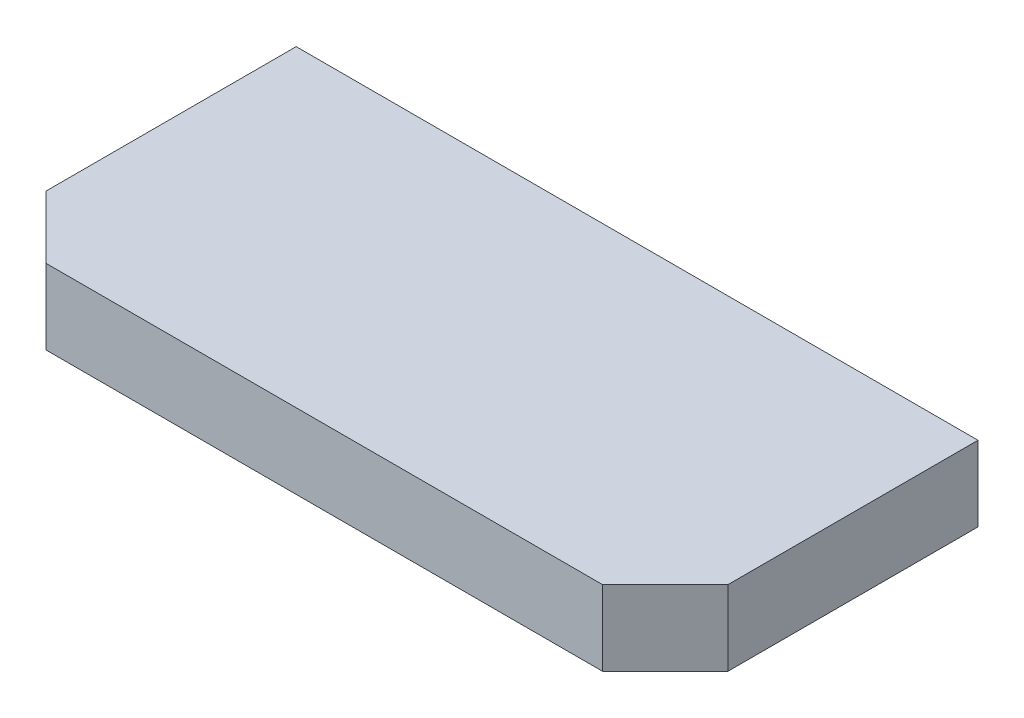
ISO-10303-21;
HEADER;
FILE_DESCRIPTION(('STEP AP214'),'2;1');
FILE_NAME('part.step','',(''),(''),'','','');
FILE_SCHEMA(('AUTOMOTIVE_DESIGN { 1 0 10303 214 1 1 1 1 }'));
ENDSEC;
DATA;
#1=APPLICATION_CONTEXT('core data for automotive mechanical design processes');
#2=APPLICATION_PROTOCOL_DEFINITION('international standard','automotive_design',2000,#1);
#3=PRODUCT_CONTEXT('',#1,'mechanical');
#4=PRODUCT('Part','Part','',(#3));
#5=PRODUCT_RELATED_PRODUCT_CATEGORY('part','',(#4));
#6=PRODUCT_DEFINITION_FORMATION('','',#4);
#7=PRODUCT_DEFINITION_CONTEXT('part definition',#1,'design');
#8=PRODUCT_DEFINITION('design','',#6,#7);
#9=PRODUCT_DEFINITION_SHAPE('','',#8);
#10=(LENGTH_UNIT() NAMED_UNIT(*) SI_UNIT(.MILLI.,.METRE.));
#11=(NAMED_UNIT(*) PLANE_ANGLE_UNIT() SI_UNIT($,.RADIAN.));
#12=(NAMED_UNIT(*) SI_UNIT($,.STERADIAN.) SOLID_ANGLE_UNIT());
#13=UNCERTAINTY_MEASURE_WITH_UNIT(LENGTH_MEASURE(1.E-05),#10,'distance_accuracy_value','');
#14=(GEOMETRIC_REPRESENTATION_CONTEXT(3) GLOBAL_UNCERTAINTY_ASSIGNED_CONTEXT((#13)) GLOBAL_UNIT_ASSIGNED_CONTEXT((#10,
#11,#12)) REPRESENTATION_CONTEXT('',''));
#15=CARTESIAN_POINT('',(0.,0.,0.));
#16=DIRECTION('',(0.,0.,1.));
#17=DIRECTION('',(1.,0.,0.));
#18=AXIS2_PLACEMENT_3D('',#15,#16,#17);
#19=CARTESIAN_POINT('',(27.25,6.,7.5));
#20=DIRECTION('',(-1.,0.,0.));
#21=DIRECTION('',(0.,0.,1.));
#22=AXIS2_PLACEMENT_3D('',#19,#20,#21);
#23=PLANE('',#22);
#24=DIRECTION('',(0.,0.,-1.));
#25=VECTOR('',#24,1.);
#26=CARTESIAN_POINT('',(27.25,0.,7.5));
#27=LINE('',#26,#25);
#28=CARTESIAN_POINT('',(27.25,0.,7.5));
#29=VERTEX_POINT('',#28);
#30=CARTESIAN_POINT('',(27.25,0.,-12.5));
#31=VERTEX_POINT('',#30);
#32=EDGE_CURVE('E120',#29,#31,#27,.T.);
#33=ORIENTED_EDGE('',*,*,#32,.T.);
#34=DIRECTION('',(0.,-1.,0.));
#35=VECTOR('',#34,1.);
#36=CARTESIAN_POINT('',(27.25,6.,-12.5));
#37=LINE('',#36,#35);
#38=CARTESIAN_POINT('',(27.25,6.,-12.5));
#39=VERTEX_POINT('',#38);
#40=EDGE_CURVE('E11',#39,#31,#37,.T.);
#41=ORIENTED_EDGE('',*,*,#40,.F.);
#42=DIRECTION('',(0.,0.,-1.));
#43=VECTOR('',#42,1.);
#44=CARTESIAN_POINT('',(27.25,6.,7.5));
#45=LINE('',#44,#43);
#46=CARTESIAN_POINT('',(27.25,6.,7.5));
#47=VERTEX_POINT('',#46);
#48=EDGE_CURVE('E130',#47,#39,#45,.T.);
#49=ORIENTED_EDGE('',*,*,#48,.F.);
#50=DIRECTION('',(0.,-1.,0.));
#51=VECTOR('',#50,1.);
#52=CARTESIAN_POINT('',(27.25,6.,7.5));
#53=LINE('',#52,#51);
#54=EDGE_CURVE('E116',#47,#29,#53,.T.);
#55=ORIENTED_EDGE('',*,*,#54,.T.);
#56=EDGE_LOOP('',(#33,#41,#49,#55));
#57=FACE_BOUND('',#56,.T.);
#58=ADVANCED_FACE('F36',(#57),#23,.F.);
#59=CARTESIAN_POINT('',(-27.25,6.,-12.5));
#60=DIRECTION('',(0.,0.,1.));
#61=DIRECTION('',(1.,0.,0.));
#62=AXIS2_PLACEMENT_3D('',#59,#60,#61);
#63=PLANE('',#62);
#64=DIRECTION('',(-1.,0.,0.));
#65=VECTOR('',#64,1.);
#66=CARTESIAN_POINT('',(-27.25,0.,-12.5));
#67=LINE('',#66,#65);
#68=CARTESIAN_POINT('',(-27.25,0.,-12.5));
#69=VERTEX_POINT('',#68);
#70=EDGE_CURVE('E123',#31,#69,#67,.T.);
#71=ORIENTED_EDGE('',*,*,#70,.T.);
#72=DIRECTION('',(0.,-1.,0.));
#73=VECTOR('',#72,1.);
#74=CARTESIAN_POINT('',(-27.25,6.,-12.5));
#75=LINE('',#74,#73);
#76=CARTESIAN_POINT('',(-27.25,6.,-12.5));
#77=VERTEX_POINT('',#76);
#78=EDGE_CURVE('E44',#77,#69,#75,.T.);
#79=ORIENTED_EDGE('',*,*,#78,.F.);
#80=DIRECTION('',(-1.,0.,0.));
#81=VECTOR('',#80,1.);
#82=CARTESIAN_POINT('',(-27.25,6.,-12.5));
#83=LINE('',#82,#81);
#84=EDGE_CURVE('E89',#39,#77,#83,.T.);
#85=ORIENTED_EDGE('',*,*,#84,.F.);
#86=ORIENTED_EDGE('',*,*,#40,.T.);
#87=EDGE_LOOP('',(#71,#79,#85,#86));
#88=FACE_BOUND('',#87,.T.);
#89=ADVANCED_FACE('F154',(#88),#63,.F.);
#90=CARTESIAN_POINT('',(-27.25,6.,7.5));
#91=DIRECTION('',(1.,0.,0.));
#92=DIRECTION('',(0.,0.,-1.));
#93=AXIS2_PLACEMENT_3D('',#90,#91,#92);
#94=PLANE('',#93);
#95=DIRECTION('',(0.,0.,1.));
#96=VECTOR('',#95,1.);
#97=CARTESIAN_POINT('',(-27.25,0.,7.5));
#98=LINE('',#97,#96);
#99=CARTESIAN_POINT('',(-27.25,0.,7.5));
#100=VERTEX_POINT('',#99);
#101=EDGE_CURVE('E125',#69,#100,#98,.T.);
#102=ORIENTED_EDGE('',*,*,#101,.T.);
#103=DIRECTION('',(0.,-1.,0.));
#104=VECTOR('',#103,1.);
#105=CARTESIAN_POINT('',(-27.25,6.,7.5));
#106=LINE('',#105,#104);
#107=CARTESIAN_POINT('',(-27.25,6.,7.5));
#108=VERTEX_POINT('',#107);
#109=EDGE_CURVE('E111',#108,#100,#106,.T.);
#110=ORIENTED_EDGE('',*,*,#109,.F.);
#111=DIRECTION('',(0.,0.,1.));
#112=VECTOR('',#111,1.);
#113=CARTESIAN_POINT('',(-27.25,6.,7.5));
#114=LINE('',#113,#112);
#115=EDGE_CURVE('E102',#77,#108,#114,.T.);
#116=ORIENTED_EDGE('',*,*,#115,.F.);
#117=ORIENTED_EDGE('',*,*,#78,.T.);
#118=EDGE_LOOP('',(#102,#110,#116,#117));
#119=FACE_BOUND('',#118,.T.);
#120=ADVANCED_FACE('F136',(#119),#94,.F.);
#121=CARTESIAN_POINT('',(-27.25,6.,7.5));
#122=DIRECTION('',(0.707106781186547,0.,-0.707106781186548));
#123=DIRECTION('',(-0.707106781186548,0.,-0.707106781186547));
#124=AXIS2_PLACEMENT_3D('',#121,#122,#123);
#125=PLANE('',#124);
#126=DIRECTION('',(0.707106781186548,0.,0.707106781186547));
#127=VECTOR('',#126,1.);
#128=CARTESIAN_POINT('',(-27.25,0.,7.5));
#129=LINE('',#128,#127);
#130=CARTESIAN_POINT('',(-22.25,0.,12.5));
#131=VERTEX_POINT('',#130);
#132=EDGE_CURVE('E110',#100,#131,#129,.T.);
#133=ORIENTED_EDGE('',*,*,#132,.T.);
#134=DIRECTION('',(0.,-1.,0.));
#135=VECTOR('',#134,1.);
#136=CARTESIAN_POINT('',(-22.25,6.,12.5));
#137=LINE('',#136,#135);
#138=CARTESIAN_POINT('',(-22.25,6.,12.5));
#139=VERTEX_POINT('',#138);
#140=EDGE_CURVE('E107',#139,#131,#137,.T.);
#141=ORIENTED_EDGE('',*,*,#140,.F.);
#142=DIRECTION('',(0.707106781186548,0.,0.707106781186547));
#143=VECTOR('',#142,1.);
#144=CARTESIAN_POINT('',(-27.25,6.,7.5));
#145=LINE('',#144,#143);
#146=EDGE_CURVE('E96',#108,#139,#145,.T.);
#147=ORIENTED_EDGE('',*,*,#146,.F.);
#148=ORIENTED_EDGE('',*,*,#109,.T.);
#149=EDGE_LOOP('',(#133,#141,#147,#148));
#150=FACE_BOUND('',#149,.T.);
#151=ADVANCED_FACE('F108',(#150),#125,.F.);
#152=CARTESIAN_POINT('',(-22.25,6.,12.5));
#153=DIRECTION('',(0.,0.,-1.));
#154=DIRECTION('',(-1.,0.,0.));
#155=AXIS2_PLACEMENT_3D('',#152,#153,#154);
#156=PLANE('',#155);
#157=DIRECTION('',(1.,0.,0.));
#158=VECTOR('',#157,1.);
#159=CARTESIAN_POINT('',(-22.25,0.,12.5));
#160=LINE('',#159,#158);
#161=CARTESIAN_POINT('',(22.25,0.,12.5));
#162=VERTEX_POINT('',#161);
#163=EDGE_CURVE('E75',#131,#162,#160,.T.);
#164=ORIENTED_EDGE('',*,*,#163,.T.);
#165=DIRECTION('',(0.,-1.,0.));
#166=VECTOR('',#165,1.);
#167=CARTESIAN_POINT('',(22.25,6.,12.5));
#168=LINE('',#167,#166);
#169=CARTESIAN_POINT('',(22.25,6.,12.5));
#170=VERTEX_POINT('',#169);
#171=EDGE_CURVE('E112',#170,#162,#168,.T.);
#172=ORIENTED_EDGE('',*,*,#171,.F.);
#173=DIRECTION('',(1.,0.,0.));
#174=VECTOR('',#173,1.);
#175=CARTESIAN_POINT('',(-22.25,6.,12.5));
#176=LINE('',#175,#174);
#177=EDGE_CURVE('E100',#139,#170,#176,.T.);
#178=ORIENTED_EDGE('',*,*,#177,.F.);
#179=ORIENTED_EDGE('',*,*,#140,.T.);
#180=EDGE_LOOP('',(#164,#172,#178,#179));
#181=FACE_BOUND('',#180,.T.);
#182=ADVANCED_FACE('F114',(#181),#156,.F.);
#183=CARTESIAN_POINT('',(22.25,6.,12.5));
#184=DIRECTION('',(-0.707106781186547,0.,-0.707106781186548));
#185=DIRECTION('',(-0.707106781186548,0.,0.707106781186547));
#186=AXIS2_PLACEMENT_3D('',#183,#184,#185);
#187=PLANE('',#186);
#188=DIRECTION('',(0.707106781186548,0.,-0.707106781186547));
#189=VECTOR('',#188,1.);
#190=CARTESIAN_POINT('',(22.25,0.,12.5));
#191=LINE('',#190,#189);
#192=EDGE_CURVE('E81',#162,#29,#191,.T.);
#193=ORIENTED_EDGE('',*,*,#192,.T.);
#194=ORIENTED_EDGE('',*,*,#54,.F.);
#195=DIRECTION('',(0.707106781186548,0.,-0.707106781186547));
#196=VECTOR('',#195,1.);
#197=CARTESIAN_POINT('',(22.25,6.,12.5));
#198=LINE('',#197,#196);
#199=EDGE_CURVE('E52',#170,#47,#198,.T.);
#200=ORIENTED_EDGE('',*,*,#199,.F.);
#201=ORIENTED_EDGE('',*,*,#171,.T.);
#202=EDGE_LOOP('',(#193,#194,#200,#201));
#203=FACE_BOUND('',#202,.T.);
#204=ADVANCED_FACE('F143',(#203),#187,.F.);
#205=CARTESIAN_POINT('',(0.,6.,0.));
#206=DIRECTION('',(0.,-1.,0.));
#207=DIRECTION('',(0.,0.,-1.));
#208=AXIS2_PLACEMENT_3D('',#205,#206,#207);
#209=PLANE('',#208);
#210=ORIENTED_EDGE('',*,*,#48,.T.);
#211=ORIENTED_EDGE('',*,*,#84,.T.);
#212=ORIENTED_EDGE('',*,*,#115,.T.);
#213=ORIENTED_EDGE('',*,*,#146,.T.);
#214=ORIENTED_EDGE('',*,*,#177,.T.);
#215=ORIENTED_EDGE('',*,*,#199,.T.);
#216=EDGE_LOOP('',(#210,#211,#212,#213,#214,#215));
#217=FACE_BOUND('',#216,.T.);
#218=ADVANCED_FACE('F98',(#217),#209,.F.);
#219=CARTESIAN_POINT('',(0.,0.,0.));
#220=DIRECTION('',(0.,-1.,0.));
#221=DIRECTION('',(0.,0.,-1.));
#222=AXIS2_PLACEMENT_3D('',#219,#220,#221);
#223=PLANE('',#222);
#224=ORIENTED_EDGE('',*,*,#32,.F.);
#225=ORIENTED_EDGE('',*,*,#192,.F.);
#226=ORIENTED_EDGE('',*,*,#163,.F.);
#227=ORIENTED_EDGE('',*,*,#132,.F.);
#228=ORIENTED_EDGE('',*,*,#101,.F.);
#229=ORIENTED_EDGE('',*,*,#70,.F.);
#230=EDGE_LOOP('',(#224,#225,#226,#227,#228,#229));
#231=FACE_BOUND('',#230,.T.);
#232=ADVANCED_FACE('F139',(#231),#223,.T.);
#233=CLOSED_SHELL('',(#58,#89,#120,#151,#182,#204,#218,#232));
#234=MANIFOLD_SOLID_BREP('B2',#233);
#235=ADVANCED_BREP_SHAPE_REPRESENTATION('',(#18,#234),#14);
#236=SHAPE_DEFINITION_REPRESENTATION(#9,#235);
ENDSEC;
END-ISO-10303-21;
